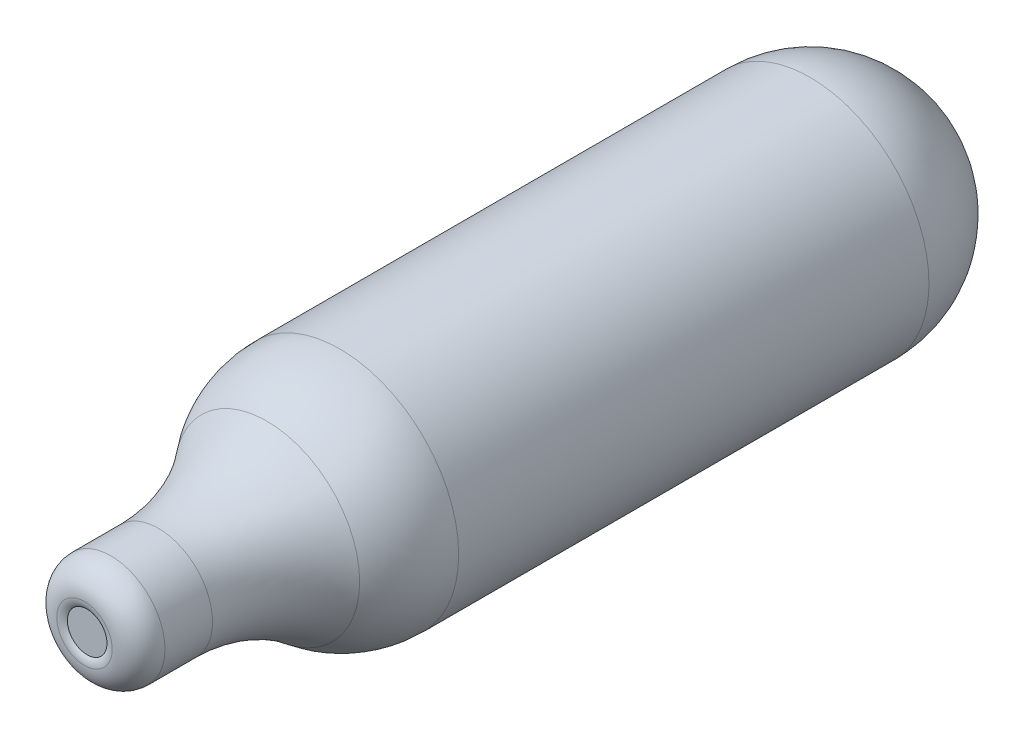
ISO-10303-21;
HEADER;
FILE_DESCRIPTION(('STEP AP214'),'2;1');
FILE_NAME('part.step','',(''),(''),'','','');
FILE_SCHEMA(('AUTOMOTIVE_DESIGN { 1 0 10303 214 1 1 1 1 }'));
ENDSEC;
DATA;
#1=APPLICATION_CONTEXT('core data for automotive mechanical design processes');
#2=APPLICATION_PROTOCOL_DEFINITION('international standard','automotive_design',2000,#1);
#3=PRODUCT_CONTEXT('',#1,'mechanical');
#4=PRODUCT('Part','Part','',(#3));
#5=PRODUCT_RELATED_PRODUCT_CATEGORY('part','',(#4));
#6=PRODUCT_DEFINITION_FORMATION('','',#4);
#7=PRODUCT_DEFINITION_CONTEXT('part definition',#1,'design');
#8=PRODUCT_DEFINITION('design','',#6,#7);
#9=PRODUCT_DEFINITION_SHAPE('','',#8);
#10=(LENGTH_UNIT() NAMED_UNIT(*) SI_UNIT(.MILLI.,.METRE.));
#11=(NAMED_UNIT(*) PLANE_ANGLE_UNIT() SI_UNIT($,.RADIAN.));
#12=(NAMED_UNIT(*) SI_UNIT($,.STERADIAN.) SOLID_ANGLE_UNIT());
#13=UNCERTAINTY_MEASURE_WITH_UNIT(LENGTH_MEASURE(1.E-05),#10,'distance_accuracy_value','');
#14=(GEOMETRIC_REPRESENTATION_CONTEXT(3) GLOBAL_UNCERTAINTY_ASSIGNED_CONTEXT((#13)) GLOBAL_UNIT_ASSIGNED_CONTEXT((#10,
#11,#12)) REPRESENTATION_CONTEXT('',''));
#15=CARTESIAN_POINT('',(0.,0.,0.));
#16=DIRECTION('',(0.,0.,1.));
#17=DIRECTION('',(1.,0.,0.));
#18=AXIS2_PLACEMENT_3D('',#15,#16,#17);
#19=CARTESIAN_POINT('',(29.9941922234478,0.,31.8238259046684));
#20=DIRECTION('',(0.,0.,1.));
#21=DIRECTION('',(1.,0.,0.));
#22=AXIS2_PLACEMENT_3D('',#19,#20,#21);
#23=PLANE('',#22);
#24=CARTESIAN_POINT('',(29.9941922234478,0.,31.8238259046684));
#25=DIRECTION('',(0.,0.,1.));
#26=DIRECTION('',(1.,0.,0.));
#27=AXIS2_PLACEMENT_3D('',#24,#25,#26);
#28=CIRCLE('',#27,1.5);
#29=CARTESIAN_POINT('',(31.4941922234478,0.,31.8238259046684));
#30=VERTEX_POINT('',#29);
#31=EDGE_CURVE('E43',#30,#30,#28,.F.);
#32=ORIENTED_EDGE('',*,*,#31,.F.);
#33=EDGE_LOOP('',(#32));
#34=FACE_BOUND('',#33,.T.);
#35=ADVANCED_FACE('F40',(#34),#23,.T.);
#36=CARTESIAN_POINT('',(29.9941922234478,0.,31.0238259046684));
#37=DIRECTION('',(0.,0.,1.));
#38=DIRECTION('',(1.,0.,0.));
#39=AXIS2_PLACEMENT_3D('',#36,#37,#38);
#40=TOROIDAL_SURFACE('',#39,2.1,1.);
#41=ORIENTED_EDGE('',*,*,#31,.T.);
#42=EDGE_LOOP('',(#41));
#43=FACE_BOUND('',#42,.T.);
#44=CARTESIAN_POINT('',(29.9941922234478,0.,32.0238259046684));
#45=DIRECTION('',(0.,0.,1.));
#46=DIRECTION('',(1.,0.,0.));
#47=AXIS2_PLACEMENT_3D('',#44,#45,#46);
#48=CIRCLE('',#47,2.1);
#49=CARTESIAN_POINT('',(32.0941922234478,0.,32.0238259046684));
#50=VERTEX_POINT('',#49);
#51=EDGE_CURVE('E71',#50,#50,#48,.F.);
#52=ORIENTED_EDGE('',*,*,#51,.F.);
#53=EDGE_LOOP('',(#52));
#54=FACE_BOUND('',#53,.T.);
#55=ADVANCED_FACE('F80',(#43,#54),#40,.T.);
#56=CARTESIAN_POINT('',(29.9941922234477,0.,30.0238259046684));
#57=DIRECTION('',(0.,0.,1.));
#58=DIRECTION('',(1.,0.,0.));
#59=AXIS2_PLACEMENT_3D('',#56,#57,#58);
#60=TOROIDAL_SURFACE('',#59,2.1,2.);
#61=ORIENTED_EDGE('',*,*,#51,.T.);
#62=EDGE_LOOP('',(#61));
#63=FACE_BOUND('',#62,.T.);
#64=CARTESIAN_POINT('',(29.9941922234477,0.,30.0238259046684));
#65=DIRECTION('',(0.,0.,1.));
#66=DIRECTION('',(1.,0.,0.));
#67=AXIS2_PLACEMENT_3D('',#64,#65,#66);
#68=CIRCLE('',#67,4.1);
#69=CARTESIAN_POINT('',(34.0941922234477,0.,30.0238259046683));
#70=VERTEX_POINT('',#69);
#71=EDGE_CURVE('E75',#70,#70,#68,.F.);
#72=ORIENTED_EDGE('',*,*,#71,.F.);
#73=EDGE_LOOP('',(#72));
#74=FACE_BOUND('',#73,.T.);
#75=ADVANCED_FACE('F83',(#63,#74),#60,.T.);
#76=CARTESIAN_POINT('',(29.9941922234476,0.,13.0238259046684));
#77=DIRECTION('',(0.,0.,1.));
#78=DIRECTION('',(1.,0.,0.));
#79=AXIS2_PLACEMENT_3D('',#76,#77,#78);
#80=CYLINDRICAL_SURFACE('',#79,4.1);
#81=ORIENTED_EDGE('',*,*,#71,.T.);
#82=EDGE_LOOP('',(#81));
#83=FACE_BOUND('',#82,.T.);
#84=CARTESIAN_POINT('',(29.9941922234477,0.,26.419163285515));
#85=DIRECTION('',(0.,0.,1.));
#86=DIRECTION('',(1.,0.,0.));
#87=AXIS2_PLACEMENT_3D('',#84,#85,#86);
#88=CIRCLE('',#87,4.1);
#89=CARTESIAN_POINT('',(34.0941922234477,0.,26.419163285515));
#90=VERTEX_POINT('',#89);
#91=EDGE_CURVE('E66',#90,#90,#88,.F.);
#92=ORIENTED_EDGE('',*,*,#91,.F.);
#93=EDGE_LOOP('',(#92));
#94=FACE_BOUND('',#93,.T.);
#95=ADVANCED_FACE('F87',(#83,#94),#80,.T.);
#96=CARTESIAN_POINT('',(29.9941922234477,0.,26.419163285515));
#97=DIRECTION('',(0.,0.,1.));
#98=DIRECTION('',(1.,0.,0.));
#99=AXIS2_PLACEMENT_3D('',#96,#97,#98);
#100=TOROIDAL_SURFACE('',#99,17.1,13.);
#101=ORIENTED_EDGE('',*,*,#91,.T.);
#102=EDGE_LOOP('',(#101));
#103=FACE_BOUND('',#102,.T.);
#104=CARTESIAN_POINT('',(29.9941922234476,0.,18.1990882229893));
#105=DIRECTION('',(0.,0.,-1.));
#106=DIRECTION('',(1.,0.,0.));
#107=AXIS2_PLACEMENT_3D('',#104,#105,#106);
#108=CIRCLE('',#107,7.02873563218391);
#109=CARTESIAN_POINT('',(37.0229278556315,0.,18.1990882229892));
#110=VERTEX_POINT('',#109);
#111=EDGE_CURVE('E62',#110,#110,#108,.T.);
#112=ORIENTED_EDGE('',*,*,#111,.F.);
#113=EDGE_LOOP('',(#112));
#114=FACE_BOUND('',#113,.T.);
#115=ADVANCED_FACE('F56',(#103,#114),#100,.F.);
#116=CARTESIAN_POINT('',(29.9941922234472,0.,-22.9761740953316));
#117=DIRECTION('',(-0.391360614623318,0.364220842227178,0.845091739049072));
#118=DIRECTION('',(0.56011797322079,0.822916016725978,-0.0952737397758897));
#119=AXIS2_PLACEMENT_3D('',#116,#117,#118);
#120=SPHERICAL_SURFACE('',#119,9.);
#121=CARTESIAN_POINT('',(33.516437755057,-3.27798758004461,-30.5819997467733));
#122=VERTEX_POINT('',#121);
#123=VERTEX_LOOP('',#122);
#124=FACE_BOUND('',#123,.T.);
#125=CARTESIAN_POINT('',(29.9941922234472,0.,-22.9761740953316));
#126=DIRECTION('',(0.,0.,1.));
#127=DIRECTION('',(1.,0.,0.));
#128=AXIS2_PLACEMENT_3D('',#125,#126,#127);
#129=CIRCLE('',#128,9.);
#130=CARTESIAN_POINT('',(38.9941922234472,0.,-22.9761740953317));
#131=VERTEX_POINT('',#130);
#132=EDGE_CURVE('E48',#131,#131,#129,.T.);
#133=ORIENTED_EDGE('',*,*,#132,.F.);
#134=EDGE_LOOP('',(#133));
#135=FACE_BOUND('',#134,.T.);
#136=ADVANCED_FACE('F52',(#124,#135),#120,.T.);
#137=CARTESIAN_POINT('',(30.2441922234476,0.,12.6663453924431));
#138=DIRECTION('',(0.,-1.,0.));
#139=DIRECTION('',(1.,0.,0.));
#140=AXIS2_PLACEMENT_3D('',#137,#138,#139);
#141=CIRCLE('',#140,8.75);
#142=TRIMMED_CURVE('',#141,(PARAMETER_VALUE(-1.59937164406419)),
(PARAMETER_VALUE(1.59937164406419)),.T.,.PARAMETER.);
#143=CARTESIAN_POINT('',(29.9941922234476,0.,12.6663453924431));
#144=DIRECTION('',(0.,0.,-1.));
#145=AXIS1_PLACEMENT('',#143,#144);
#146=SURFACE_OF_REVOLUTION('',#142,#145);
#147=ORIENTED_EDGE('',*,*,#111,.T.);
#148=EDGE_LOOP('',(#147));
#149=FACE_BOUND('',#148,.T.);
#150=CARTESIAN_POINT('',(29.9941922234476,0.,12.6663453924431));
#151=DIRECTION('',(0.,0.,1.));
#152=DIRECTION('',(1.,0.,0.));
#153=AXIS2_PLACEMENT_3D('',#150,#151,#152);
#154=CIRCLE('',#153,9.);
#155=CARTESIAN_POINT('',(38.9941922234476,0.,12.666345392443));
#156=VERTEX_POINT('',#155);
#157=EDGE_CURVE('E11',#156,#156,#154,.F.);
#158=ORIENTED_EDGE('',*,*,#157,.F.);
#159=EDGE_LOOP('',(#158));
#160=FACE_BOUND('',#159,.T.);
#161=ADVANCED_FACE('F55',(#149,#160),#146,.F.);
#162=CARTESIAN_POINT('',(29.9941922234471,0.,-31.9761740953316));
#163=DIRECTION('',(0.,0.,1.));
#164=DIRECTION('',(1.,0.,0.));
#165=AXIS2_PLACEMENT_3D('',#162,#163,#164);
#166=CYLINDRICAL_SURFACE('',#165,9.);
#167=ORIENTED_EDGE('',*,*,#132,.T.);
#168=EDGE_LOOP('',(#167));
#169=FACE_BOUND('',#168,.T.);
#170=ORIENTED_EDGE('',*,*,#157,.T.);
#171=EDGE_LOOP('',(#170));
#172=FACE_BOUND('',#171,.T.);
#173=ADVANCED_FACE('F114',(#169,#172),#166,.T.);
#174=CLOSED_SHELL('',(#35,#55,#75,#95,#115,#136,#161,#173));
#175=MANIFOLD_SOLID_BREP('B2',#174);
#176=ADVANCED_BREP_SHAPE_REPRESENTATION('',(#18,#175),#14);
#177=SHAPE_DEFINITION_REPRESENTATION(#9,#176);
ENDSEC;
END-ISO-10303-21;
